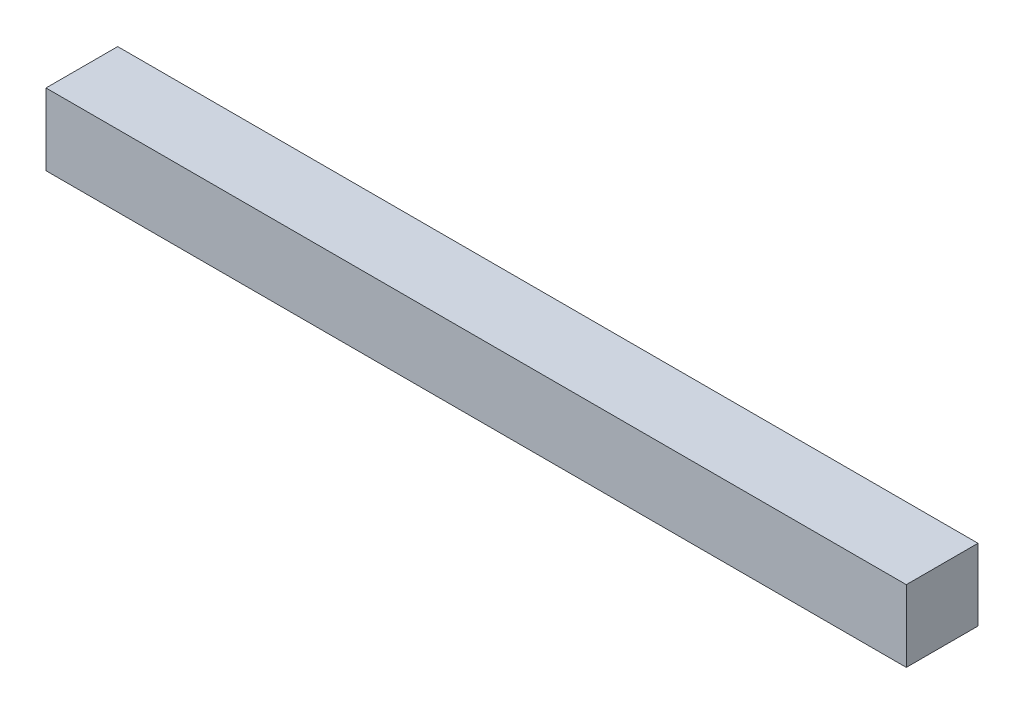
ISO-10303-21;
HEADER;
FILE_DESCRIPTION(('STEP AP214'),'2;1');
FILE_NAME('part.step','',(''),(''),'','','');
FILE_SCHEMA(('AUTOMOTIVE_DESIGN { 1 0 10303 214 1 1 1 1 }'));
ENDSEC;
DATA;
#1=APPLICATION_CONTEXT('core data for automotive mechanical design processes');
#2=APPLICATION_PROTOCOL_DEFINITION('international standard','automotive_design',2000,#1);
#3=PRODUCT_CONTEXT('',#1,'mechanical');
#4=PRODUCT('Part','Part','',(#3));
#5=PRODUCT_RELATED_PRODUCT_CATEGORY('part','',(#4));
#6=PRODUCT_DEFINITION_FORMATION('','',#4);
#7=PRODUCT_DEFINITION_CONTEXT('part definition',#1,'design');
#8=PRODUCT_DEFINITION('design','',#6,#7);
#9=PRODUCT_DEFINITION_SHAPE('','',#8);
#10=(LENGTH_UNIT() NAMED_UNIT(*) SI_UNIT(.MILLI.,.METRE.));
#11=(NAMED_UNIT(*) PLANE_ANGLE_UNIT() SI_UNIT($,.RADIAN.));
#12=(NAMED_UNIT(*) SI_UNIT($,.STERADIAN.) SOLID_ANGLE_UNIT());
#13=UNCERTAINTY_MEASURE_WITH_UNIT(LENGTH_MEASURE(1.E-05),#10,'distance_accuracy_value','');
#14=(GEOMETRIC_REPRESENTATION_CONTEXT(3) GLOBAL_UNCERTAINTY_ASSIGNED_CONTEXT((#13)) GLOBAL_UNIT_ASSIGNED_CONTEXT((#10,
#11,#12)) REPRESENTATION_CONTEXT('',''));
#15=CARTESIAN_POINT('',(0.,0.,0.));
#16=DIRECTION('',(0.,0.,1.));
#17=DIRECTION('',(1.,0.,0.));
#18=AXIS2_PLACEMENT_3D('',#15,#16,#17);
#19=CARTESIAN_POINT('',(-1.025,1.55,3.3));
#20=DIRECTION('',(0.,-1.,0.));
#21=DIRECTION('',(0.,0.,-1.));
#22=AXIS2_PLACEMENT_3D('',#19,#20,#21);
#23=PLANE('',#22);
#24=DIRECTION('',(0.,0.,1.));
#25=VECTOR('',#24,1.);
#26=CARTESIAN_POINT('',(-2.225,1.55,3.3));
#27=LINE('',#26,#25);
#28=CARTESIAN_POINT('',(-2.225,1.55,3.2));
#29=VERTEX_POINT('',#28);
#30=CARTESIAN_POINT('',(-2.225,1.55,3.3));
#31=VERTEX_POINT('',#30);
#32=EDGE_CURVE('E57',#29,#31,#27,.T.);
#33=ORIENTED_EDGE('',*,*,#32,.F.);
#34=DIRECTION('',(-1.,0.,0.));
#35=VECTOR('',#34,1.);
#36=CARTESIAN_POINT('',(-2.225,1.55,3.2));
#37=LINE('',#36,#35);
#38=CARTESIAN_POINT('',(-1.025,1.55,3.2));
#39=VERTEX_POINT('',#38);
#40=EDGE_CURVE('E52',#39,#29,#37,.T.);
#41=ORIENTED_EDGE('',*,*,#40,.F.);
#42=DIRECTION('',(0.,0.,-1.));
#43=VECTOR('',#42,1.);
#44=CARTESIAN_POINT('',(-1.025,1.55,3.2));
#45=LINE('',#44,#43);
#46=CARTESIAN_POINT('',(-1.025,1.55,3.3));
#47=VERTEX_POINT('',#46);
#48=EDGE_CURVE('E67',#47,#39,#45,.T.);
#49=ORIENTED_EDGE('',*,*,#48,.F.);
#50=DIRECTION('',(1.,0.,0.));
#51=VECTOR('',#50,1.);
#52=CARTESIAN_POINT('',(-1.025,1.55,3.3));
#53=LINE('',#52,#51);
#54=EDGE_CURVE('E19',#31,#47,#53,.T.);
#55=ORIENTED_EDGE('',*,*,#54,.F.);
#56=EDGE_LOOP('',(#33,#41,#49,#55));
#57=FACE_BOUND('',#56,.T.);
#58=ADVANCED_FACE('F16',(#57),#23,.T.);
#59=CARTESIAN_POINT('',(-1.025,1.65,3.3));
#60=DIRECTION('',(0.,0.,1.));
#61=DIRECTION('',(1.,0.,0.));
#62=AXIS2_PLACEMENT_3D('',#59,#60,#61);
#63=PLANE('',#62);
#64=DIRECTION('',(1.,0.,0.));
#65=VECTOR('',#64,1.);
#66=CARTESIAN_POINT('',(-1.025,1.65,3.3));
#67=LINE('',#66,#65);
#68=CARTESIAN_POINT('',(-1.025,1.65,3.3));
#69=VERTEX_POINT('',#68);
#70=CARTESIAN_POINT('',(-2.225,1.65,3.3));
#71=VERTEX_POINT('',#70);
#72=EDGE_CURVE('E73',#69,#71,#67,.F.);
#73=ORIENTED_EDGE('',*,*,#72,.T.);
#74=DIRECTION('',(0.,1.,0.));
#75=VECTOR('',#74,1.);
#76=CARTESIAN_POINT('',(-2.225,1.65,3.3));
#77=LINE('',#76,#75);
#78=EDGE_CURVE('E62',#31,#71,#77,.T.);
#79=ORIENTED_EDGE('',*,*,#78,.F.);
#80=ORIENTED_EDGE('',*,*,#54,.T.);
#81=DIRECTION('',(0.,1.,0.));
#82=VECTOR('',#81,1.);
#83=CARTESIAN_POINT('',(-1.025,1.65,3.3));
#84=LINE('',#83,#82);
#85=EDGE_CURVE('E80',#69,#47,#84,.F.);
#86=ORIENTED_EDGE('',*,*,#85,.F.);
#87=EDGE_LOOP('',(#73,#79,#80,#86));
#88=FACE_BOUND('',#87,.T.);
#89=ADVANCED_FACE('F72',(#88),#63,.T.);
#90=CARTESIAN_POINT('',(-2.225,1.65,3.3));
#91=DIRECTION('',(-1.,0.,0.));
#92=DIRECTION('',(0.,0.,1.));
#93=AXIS2_PLACEMENT_3D('',#90,#91,#92);
#94=PLANE('',#93);
#95=DIRECTION('',(0.,0.,-1.));
#96=VECTOR('',#95,1.);
#97=CARTESIAN_POINT('',(-2.225,1.65,3.3));
#98=LINE('',#97,#96);
#99=CARTESIAN_POINT('',(-2.225,1.65,3.2));
#100=VERTEX_POINT('',#99);
#101=EDGE_CURVE('E83',#71,#100,#98,.T.);
#102=ORIENTED_EDGE('',*,*,#101,.T.);
#103=DIRECTION('',(0.,1.,0.));
#104=VECTOR('',#103,1.);
#105=CARTESIAN_POINT('',(-2.225,1.65,3.2));
#106=LINE('',#105,#104);
#107=EDGE_CURVE('E64',#29,#100,#106,.T.);
#108=ORIENTED_EDGE('',*,*,#107,.F.);
#109=ORIENTED_EDGE('',*,*,#32,.T.);
#110=ORIENTED_EDGE('',*,*,#78,.T.);
#111=EDGE_LOOP('',(#102,#108,#109,#110));
#112=FACE_BOUND('',#111,.T.);
#113=ADVANCED_FACE('F60',(#112),#94,.T.);
#114=CARTESIAN_POINT('',(-2.225,1.65,3.2));
#115=DIRECTION('',(0.,0.,-1.));
#116=DIRECTION('',(-1.,0.,0.));
#117=AXIS2_PLACEMENT_3D('',#114,#115,#116);
#118=PLANE('',#117);
#119=DIRECTION('',(1.,0.,0.));
#120=VECTOR('',#119,1.);
#121=CARTESIAN_POINT('',(-1.025,1.65,3.2));
#122=LINE('',#121,#120);
#123=CARTESIAN_POINT('',(-1.025,1.65,3.2));
#124=VERTEX_POINT('',#123);
#125=EDGE_CURVE('E25',#100,#124,#122,.T.);
#126=ORIENTED_EDGE('',*,*,#125,.T.);
#127=DIRECTION('',(0.,1.,0.));
#128=VECTOR('',#127,1.);
#129=CARTESIAN_POINT('',(-1.025,1.65,3.2));
#130=LINE('',#129,#128);
#131=EDGE_CURVE('E33',#39,#124,#130,.T.);
#132=ORIENTED_EDGE('',*,*,#131,.F.);
#133=ORIENTED_EDGE('',*,*,#40,.T.);
#134=ORIENTED_EDGE('',*,*,#107,.T.);
#135=EDGE_LOOP('',(#126,#132,#133,#134));
#136=FACE_BOUND('',#135,.T.);
#137=ADVANCED_FACE('F87',(#136),#118,.T.);
#138=CARTESIAN_POINT('',(-1.025,1.65,3.2));
#139=DIRECTION('',(1.,0.,0.));
#140=DIRECTION('',(0.,0.,-1.));
#141=AXIS2_PLACEMENT_3D('',#138,#139,#140);
#142=PLANE('',#141);
#143=DIRECTION('',(0.,0.,-1.));
#144=VECTOR('',#143,1.);
#145=CARTESIAN_POINT('',(-1.025,1.65,3.3));
#146=LINE('',#145,#144);
#147=EDGE_CURVE('E11',#124,#69,#146,.F.);
#148=ORIENTED_EDGE('',*,*,#147,.T.);
#149=ORIENTED_EDGE('',*,*,#85,.T.);
#150=ORIENTED_EDGE('',*,*,#48,.T.);
#151=ORIENTED_EDGE('',*,*,#131,.T.);
#152=EDGE_LOOP('',(#148,#149,#150,#151));
#153=FACE_BOUND('',#152,.T.);
#154=ADVANCED_FACE('F90',(#153),#142,.T.);
#155=CARTESIAN_POINT('',(-1.025,1.65,3.3));
#156=DIRECTION('',(0.,-1.,0.));
#157=DIRECTION('',(0.,0.,-1.));
#158=AXIS2_PLACEMENT_3D('',#155,#156,#157);
#159=PLANE('',#158);
#160=ORIENTED_EDGE('',*,*,#125,.F.);
#161=ORIENTED_EDGE('',*,*,#101,.F.);
#162=ORIENTED_EDGE('',*,*,#72,.F.);
#163=ORIENTED_EDGE('',*,*,#147,.F.);
#164=EDGE_LOOP('',(#160,#161,#162,#163));
#165=FACE_BOUND('',#164,.T.);
#166=ADVANCED_FACE('F89',(#165),#159,.F.);
#167=CLOSED_SHELL('',(#58,#89,#113,#137,#154,#166));
#168=MANIFOLD_SOLID_BREP('B1',#167);
#169=ADVANCED_BREP_SHAPE_REPRESENTATION('',(#18,#168),#14);
#170=SHAPE_DEFINITION_REPRESENTATION(#9,#169);
ENDSEC;
END-ISO-10303-21;
